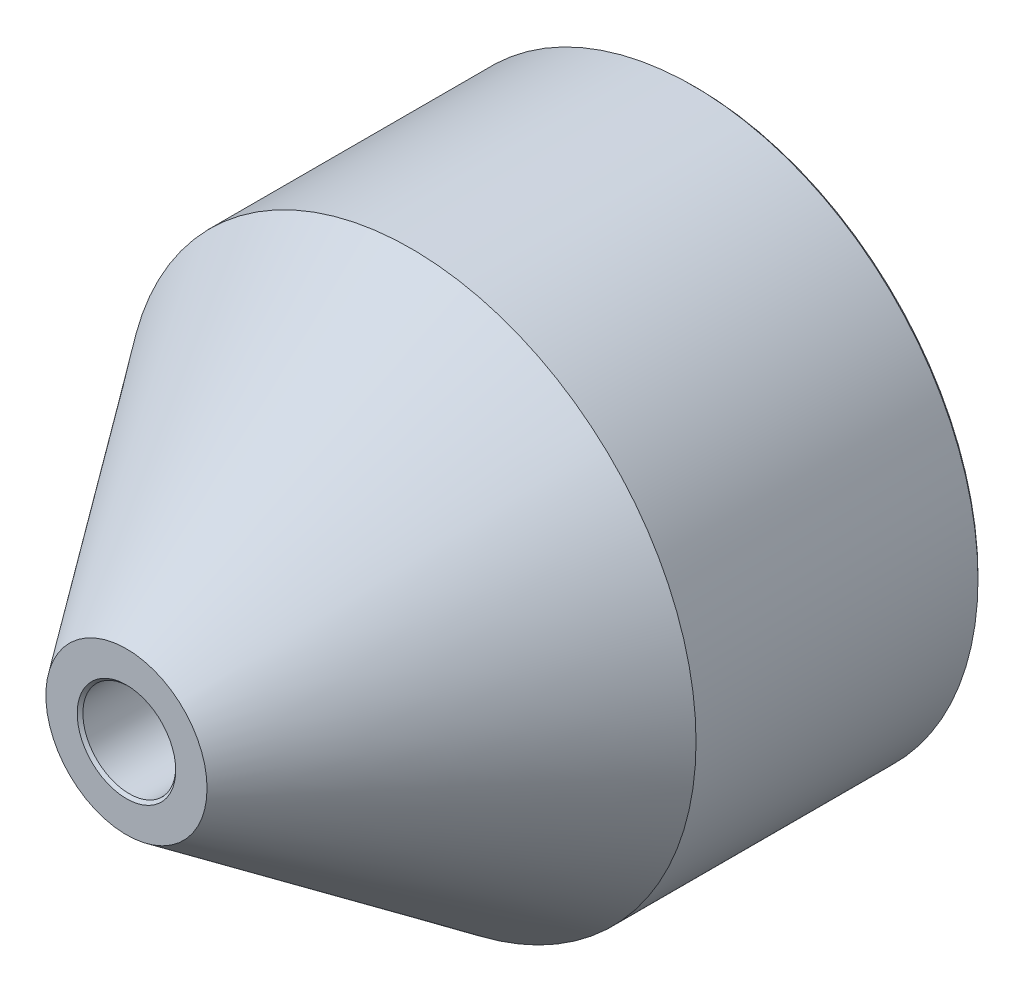
ISO-10303-21;
HEADER;
FILE_DESCRIPTION(('STEP AP214'),'2;1');
FILE_NAME('part.step','',(''),(''),'','','');
FILE_SCHEMA(('AUTOMOTIVE_DESIGN { 1 0 10303 214 1 1 1 1 }'));
ENDSEC;
DATA;
#1=APPLICATION_CONTEXT('core data for automotive mechanical design processes');
#2=APPLICATION_PROTOCOL_DEFINITION('international standard','automotive_design',2000,#1);
#3=PRODUCT_CONTEXT('',#1,'mechanical');
#4=PRODUCT('Part','Part','',(#3));
#5=PRODUCT_RELATED_PRODUCT_CATEGORY('part','',(#4));
#6=PRODUCT_DEFINITION_FORMATION('','',#4);
#7=PRODUCT_DEFINITION_CONTEXT('part definition',#1,'design');
#8=PRODUCT_DEFINITION('design','',#6,#7);
#9=PRODUCT_DEFINITION_SHAPE('','',#8);
#10=(LENGTH_UNIT() NAMED_UNIT(*) SI_UNIT(.MILLI.,.METRE.));
#11=(NAMED_UNIT(*) PLANE_ANGLE_UNIT() SI_UNIT($,.RADIAN.));
#12=(NAMED_UNIT(*) SI_UNIT($,.STERADIAN.) SOLID_ANGLE_UNIT());
#13=UNCERTAINTY_MEASURE_WITH_UNIT(LENGTH_MEASURE(1.E-05),#10,'distance_accuracy_value','');
#14=(GEOMETRIC_REPRESENTATION_CONTEXT(3) GLOBAL_UNCERTAINTY_ASSIGNED_CONTEXT((#13)) GLOBAL_UNIT_ASSIGNED_CONTEXT((#10,
#11,#12)) REPRESENTATION_CONTEXT('',''));
#15=CARTESIAN_POINT('',(0.,0.,0.));
#16=DIRECTION('',(0.,0.,1.));
#17=DIRECTION('',(1.,0.,0.));
#18=AXIS2_PLACEMENT_3D('',#15,#16,#17);
#19=CARTESIAN_POINT('',(0.,0.,-27.7364787404203));
#20=DIRECTION('',(0.,0.,-1.));
#21=DIRECTION('',(-1.,0.,0.));
#22=AXIS2_PLACEMENT_3D('',#19,#20,#21);
#23=PLANE('',#22);
#24=CARTESIAN_POINT('',(0.,0.,-27.7364787404203));
#25=DIRECTION('',(0.,0.,1.));
#26=DIRECTION('',(1.,0.,0.));
#27=AXIS2_PLACEMENT_3D('',#24,#25,#26);
#28=CIRCLE('',#27,4.15);
#29=CARTESIAN_POINT('',(4.14999999999999,0.,-27.7364787404203));
#30=VERTEX_POINT('',#29);
#31=EDGE_CURVE('E63',#30,#30,#28,.T.);
#32=ORIENTED_EDGE('',*,*,#31,.F.);
#33=EDGE_LOOP('',(#32));
#34=FACE_BOUND('',#33,.T.);
#35=ADVANCED_FACE('F35',(#34),#23,.T.);
#36=CARTESIAN_POINT('',(0.,0.,12.2635212595797));
#37=DIRECTION('',(0.,0.,1.));
#38=DIRECTION('',(1.,0.,0.));
#39=AXIS2_PLACEMENT_3D('',#36,#37,#38);
#40=CYLINDRICAL_SURFACE('',#39,4.15);
#41=CARTESIAN_POINT('',(0.,0.,-37.2364787404202));
#42=DIRECTION('',(0.,0.,-1.));
#43=DIRECTION('',(-1.,0.,0.));
#44=AXIS2_PLACEMENT_3D('',#41,#42,#43);
#45=CIRCLE('',#44,4.15);
#46=CARTESIAN_POINT('',(-4.15000000000001,0.,-37.2364787404202));
#47=VERTEX_POINT('',#46);
#48=EDGE_CURVE('E10',#47,#47,#45,.T.);
#49=ORIENTED_EDGE('',*,*,#48,.T.);
#50=EDGE_LOOP('',(#49));
#51=FACE_BOUND('',#50,.T.);
#52=ORIENTED_EDGE('',*,*,#31,.T.);
#53=EDGE_LOOP('',(#52));
#54=FACE_BOUND('',#53,.T.);
#55=ADVANCED_FACE('F94',(#51,#54),#40,.F.);
#56=CARTESIAN_POINT('',(4.14999999999999,0.,-37.7364787404203));
#57=DIRECTION('',(0.,0.,-1.));
#58=DIRECTION('',(-1.,0.,0.));
#59=AXIS2_PLACEMENT_3D('',#56,#57,#58);
#60=PLANE('',#59);
#61=CARTESIAN_POINT('',(0.,0.,-37.7364787404203));
#62=DIRECTION('',(0.,0.,-1.));
#63=DIRECTION('',(-1.,0.,0.));
#64=AXIS2_PLACEMENT_3D('',#61,#62,#63);
#65=CIRCLE('',#64,49.5);
#66=CARTESIAN_POINT('',(-49.5,0.,-37.7364787404203));
#67=VERTEX_POINT('',#66);
#68=EDGE_CURVE('E42',#67,#67,#65,.T.);
#69=ORIENTED_EDGE('',*,*,#68,.T.);
#70=EDGE_LOOP('',(#69));
#71=FACE_BOUND('',#70,.T.);
#72=CARTESIAN_POINT('',(0.,0.,-37.7364787404203));
#73=DIRECTION('',(0.,0.,-1.));
#74=DIRECTION('',(-1.,0.,0.));
#75=AXIS2_PLACEMENT_3D('',#72,#73,#74);
#76=CIRCLE('',#75,4.65000000000001);
#77=CARTESIAN_POINT('',(-4.65000000000002,0.,-37.7364787404203));
#78=VERTEX_POINT('',#77);
#79=EDGE_CURVE('E47',#78,#78,#76,.F.);
#80=ORIENTED_EDGE('',*,*,#79,.T.);
#81=EDGE_LOOP('',(#80));
#82=FACE_BOUND('',#81,.T.);
#83=ADVANCED_FACE('F100',(#71,#82),#60,.T.);
#84=CARTESIAN_POINT('',(0.,0.,12.2635212595797));
#85=DIRECTION('',(0.,0.,1.));
#86=DIRECTION('',(1.,0.,0.));
#87=AXIS2_PLACEMENT_3D('',#84,#85,#86);
#88=CYLINDRICAL_SURFACE('',#87,50.);
#89=CARTESIAN_POINT('',(0.,0.,-37.2364787404203));
#90=DIRECTION('',(0.,0.,-1.));
#91=DIRECTION('',(-1.,0.,0.));
#92=AXIS2_PLACEMENT_3D('',#89,#90,#91);
#93=CIRCLE('',#92,50.);
#94=CARTESIAN_POINT('',(-50.,0.,-37.2364787404203));
#95=VERTEX_POINT('',#94);
#96=EDGE_CURVE('E52',#95,#95,#93,.F.);
#97=ORIENTED_EDGE('',*,*,#96,.T.);
#98=EDGE_LOOP('',(#97));
#99=FACE_BOUND('',#98,.T.);
#100=CARTESIAN_POINT('',(0.,0.,12.2635212595797));
#101=DIRECTION('',(0.,0.,1.));
#102=DIRECTION('',(1.,0.,0.));
#103=AXIS2_PLACEMENT_3D('',#100,#101,#102);
#104=CIRCLE('',#103,50.);
#105=CARTESIAN_POINT('',(50.,0.,12.2635212595797));
#106=VERTEX_POINT('',#105);
#107=EDGE_CURVE('E66',#106,#106,#104,.T.);
#108=ORIENTED_EDGE('',*,*,#107,.F.);
#109=EDGE_LOOP('',(#108));
#110=FACE_BOUND('',#109,.T.);
#111=ADVANCED_FACE('F117',(#99,#110),#88,.T.);
#112=CARTESIAN_POINT('',(0.,0.,62.2635212595797));
#113=DIRECTION('',(0.,0.,-1.));
#114=DIRECTION('',(-1.,0.,0.));
#115=AXIS2_PLACEMENT_3D('',#112,#113,#114);
#116=CONICAL_SURFACE('',#115,14.15,0.622044476969505);
#117=ORIENTED_EDGE('',*,*,#107,.T.);
#118=EDGE_LOOP('',(#117));
#119=FACE_BOUND('',#118,.T.);
#120=CARTESIAN_POINT('',(0.,0.,62.2635212595797));
#121=DIRECTION('',(0.,0.,1.));
#122=DIRECTION('',(1.,0.,0.));
#123=AXIS2_PLACEMENT_3D('',#120,#121,#122);
#124=CIRCLE('',#123,14.15);
#125=CARTESIAN_POINT('',(14.15,0.,62.2635212595797));
#126=VERTEX_POINT('',#125);
#127=EDGE_CURVE('E69',#126,#126,#124,.T.);
#128=ORIENTED_EDGE('',*,*,#127,.F.);
#129=EDGE_LOOP('',(#128));
#130=FACE_BOUND('',#129,.T.);
#131=ADVANCED_FACE('F90',(#119,#130),#116,.T.);
#132=CARTESIAN_POINT('',(14.15,0.,62.2635212595797));
#133=DIRECTION('',(0.,0.,1.));
#134=DIRECTION('',(1.,0.,0.));
#135=AXIS2_PLACEMENT_3D('',#132,#133,#134);
#136=PLANE('',#135);
#137=CARTESIAN_POINT('',(0.,0.,62.2635212595797));
#138=DIRECTION('',(0.,0.,1.));
#139=DIRECTION('',(1.,0.,0.));
#140=AXIS2_PLACEMENT_3D('',#137,#138,#139);
#141=CIRCLE('',#140,8.64999999999992);
#142=CARTESIAN_POINT('',(8.64999999999993,0.,62.2635212595797));
#143=VERTEX_POINT('',#142);
#144=EDGE_CURVE('E57',#143,#143,#141,.F.);
#145=ORIENTED_EDGE('',*,*,#144,.T.);
#146=EDGE_LOOP('',(#145));
#147=FACE_BOUND('',#146,.T.);
#148=ORIENTED_EDGE('',*,*,#127,.T.);
#149=EDGE_LOOP('',(#148));
#150=FACE_BOUND('',#149,.T.);
#151=ADVANCED_FACE('F81',(#147,#150),#136,.T.);
#152=CARTESIAN_POINT('',(0.,0.,12.2635212595797));
#153=DIRECTION('',(0.,0.,1.));
#154=DIRECTION('',(1.,0.,0.));
#155=AXIS2_PLACEMENT_3D('',#152,#153,#154);
#156=CYLINDRICAL_SURFACE('',#155,8.15);
#157=CARTESIAN_POINT('',(0.,0.,61.7635212595798));
#158=DIRECTION('',(0.,0.,1.));
#159=DIRECTION('',(1.,0.,0.));
#160=AXIS2_PLACEMENT_3D('',#157,#158,#159);
#161=CIRCLE('',#160,8.15);
#162=CARTESIAN_POINT('',(8.15000000000001,0.,61.7635212595798));
#163=VERTEX_POINT('',#162);
#164=EDGE_CURVE('E60',#163,#163,#161,.T.);
#165=ORIENTED_EDGE('',*,*,#164,.T.);
#166=EDGE_LOOP('',(#165));
#167=FACE_BOUND('',#166,.T.);
#168=CARTESIAN_POINT('',(0.,0.,12.2635212595797));
#169=DIRECTION('',(0.,0.,1.));
#170=DIRECTION('',(1.,0.,0.));
#171=AXIS2_PLACEMENT_3D('',#168,#169,#170);
#172=CIRCLE('',#171,8.15);
#173=CARTESIAN_POINT('',(8.15,0.,12.2635212595797));
#174=VERTEX_POINT('',#173);
#175=EDGE_CURVE('E72',#174,#174,#172,.T.);
#176=ORIENTED_EDGE('',*,*,#175,.F.);
#177=EDGE_LOOP('',(#176));
#178=FACE_BOUND('',#177,.T.);
#179=ADVANCED_FACE('F79',(#167,#178),#156,.F.);
#180=CARTESIAN_POINT('',(8.15,0.,12.2635212595797));
#181=DIRECTION('',(0.,0.,1.));
#182=DIRECTION('',(1.,0.,0.));
#183=AXIS2_PLACEMENT_3D('',#180,#181,#182);
#184=PLANE('',#183);
#185=ORIENTED_EDGE('',*,*,#175,.T.);
#186=EDGE_LOOP('',(#185));
#187=FACE_BOUND('',#186,.T.);
#188=ADVANCED_FACE('F77',(#187),#184,.T.);
#189=CARTESIAN_POINT('',(0.,0.,61.7635212595798));
#190=DIRECTION('',(0.,0.,1.));
#191=DIRECTION('',(1.,0.,0.));
#192=AXIS2_PLACEMENT_3D('',#189,#190,#191);
#193=CONICAL_SURFACE('',#192,8.15,0.785398163397419);
#194=ORIENTED_EDGE('',*,*,#144,.F.);
#195=EDGE_LOOP('',(#194));
#196=FACE_BOUND('',#195,.T.);
#197=ORIENTED_EDGE('',*,*,#164,.F.);
#198=EDGE_LOOP('',(#197));
#199=FACE_BOUND('',#198,.T.);
#200=ADVANCED_FACE('F88',(#196,#199),#193,.F.);
#201=CARTESIAN_POINT('',(0.,0.,-37.2364787404203));
#202=DIRECTION('',(0.,0.,1.));
#203=DIRECTION('',(1.,0.,0.));
#204=AXIS2_PLACEMENT_3D('',#201,#202,#203);
#205=CONICAL_SURFACE('',#204,50.,0.785398163397455);
#206=ORIENTED_EDGE('',*,*,#68,.F.);
#207=EDGE_LOOP('',(#206));
#208=FACE_BOUND('',#207,.T.);
#209=ORIENTED_EDGE('',*,*,#96,.F.);
#210=EDGE_LOOP('',(#209));
#211=FACE_BOUND('',#210,.T.);
#212=ADVANCED_FACE('F106',(#208,#211),#205,.T.);
#213=CARTESIAN_POINT('',(0.,0.,-37.7364787404203));
#214=DIRECTION('',(0.,0.,-1.));
#215=DIRECTION('',(-1.,0.,0.));
#216=AXIS2_PLACEMENT_3D('',#213,#214,#215);
#217=CONICAL_SURFACE('',#216,4.65000000000001,0.785398163397435);
#218=ORIENTED_EDGE('',*,*,#48,.F.);
#219=EDGE_LOOP('',(#218));
#220=FACE_BOUND('',#219,.T.);
#221=ORIENTED_EDGE('',*,*,#79,.F.);
#222=EDGE_LOOP('',(#221));
#223=FACE_BOUND('',#222,.T.);
#224=ADVANCED_FACE('F37',(#220,#223),#217,.F.);
#225=CLOSED_SHELL('',(#35,#55,#83,#111,#131,#151,#179,#188,#200,#212,#224));
#226=MANIFOLD_SOLID_BREP('B2',#225);
#227=ADVANCED_BREP_SHAPE_REPRESENTATION('',(#18,#226),#14);
#228=SHAPE_DEFINITION_REPRESENTATION(#9,#227);
ENDSEC;
END-ISO-10303-21;
